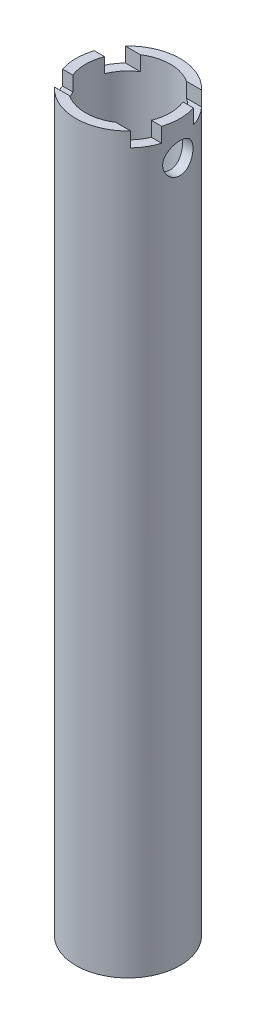
ISO-10303-21;
HEADER;
FILE_DESCRIPTION(('STEP AP214'),'2;1');
FILE_NAME('part.step','',(''),(''),'','','');
FILE_SCHEMA(('AUTOMOTIVE_DESIGN { 1 0 10303 214 1 1 1 1 }'));
ENDSEC;
DATA;
#1=APPLICATION_CONTEXT('core data for automotive mechanical design processes');
#2=APPLICATION_PROTOCOL_DEFINITION('international standard','automotive_design',2000,#1);
#3=PRODUCT_CONTEXT('',#1,'mechanical');
#4=PRODUCT('Part','Part','',(#3));
#5=PRODUCT_RELATED_PRODUCT_CATEGORY('part','',(#4));
#6=PRODUCT_DEFINITION_FORMATION('','',#4);
#7=PRODUCT_DEFINITION_CONTEXT('part definition',#1,'design');
#8=PRODUCT_DEFINITION('design','',#6,#7);
#9=PRODUCT_DEFINITION_SHAPE('','',#8);
#10=(LENGTH_UNIT() NAMED_UNIT(*) SI_UNIT(.MILLI.,.METRE.));
#11=(NAMED_UNIT(*) PLANE_ANGLE_UNIT() SI_UNIT($,.RADIAN.));
#12=(NAMED_UNIT(*) SI_UNIT($,.STERADIAN.) SOLID_ANGLE_UNIT());
#13=UNCERTAINTY_MEASURE_WITH_UNIT(LENGTH_MEASURE(1.E-05),#10,'distance_accuracy_value','');
#14=(GEOMETRIC_REPRESENTATION_CONTEXT(3) GLOBAL_UNCERTAINTY_ASSIGNED_CONTEXT((#13)) GLOBAL_UNIT_ASSIGNED_CONTEXT((#10,
#11,#12)) REPRESENTATION_CONTEXT('',''));
#15=CARTESIAN_POINT('',(0.,0.,0.));
#16=DIRECTION('',(0.,0.,1.));
#17=DIRECTION('',(1.,0.,0.));
#18=AXIS2_PLACEMENT_3D('',#15,#16,#17);
#19=CARTESIAN_POINT('',(0.,0.,0.));
#20=DIRECTION('',(0.,1.,0.));
#21=DIRECTION('',(0.,0.,1.));
#22=AXIS2_PLACEMENT_3D('',#19,#20,#21);
#23=PLANE('',#22);
#24=CARTESIAN_POINT('',(0.,0.,0.));
#25=DIRECTION('',(0.,1.,0.));
#26=DIRECTION('',(0.,0.,1.));
#27=AXIS2_PLACEMENT_3D('',#24,#25,#26);
#28=CIRCLE('',#27,10.65);
#29=CARTESIAN_POINT('',(10.1419919148065,0.,3.25));
#30=VERTEX_POINT('',#29);
#31=CARTESIAN_POINT('',(10.1419919148065,0.,-3.25));
#32=VERTEX_POINT('',#31);
#33=EDGE_CURVE('E311',#30,#32,#28,.T.);
#34=ORIENTED_EDGE('',*,*,#33,.T.);
#35=DIRECTION('',(-1.,0.,0.));
#36=VECTOR('',#35,1.);
#37=CARTESIAN_POINT('',(0.,0.,-3.25));
#38=LINE('',#37,#36);
#39=CARTESIAN_POINT('',(8.01623352953244,0.,-3.25));
#40=VERTEX_POINT('',#39);
#41=EDGE_CURVE('E182',#32,#40,#38,.T.);
#42=ORIENTED_EDGE('',*,*,#41,.T.);
#43=CARTESIAN_POINT('',(0.,0.,0.));
#44=DIRECTION('',(0.,1.,0.));
#45=DIRECTION('',(0.,0.,1.));
#46=AXIS2_PLACEMENT_3D('',#43,#44,#45);
#47=CIRCLE('',#46,8.65);
#48=CARTESIAN_POINT('',(8.01623352953244,0.,3.25));
#49=VERTEX_POINT('',#48);
#50=EDGE_CURVE('E306',#49,#40,#47,.T.);
#51=ORIENTED_EDGE('',*,*,#50,.F.);
#52=DIRECTION('',(1.,0.,0.));
#53=VECTOR('',#52,1.);
#54=CARTESIAN_POINT('',(0.,0.,3.25));
#55=LINE('',#54,#53);
#56=EDGE_CURVE('E226',#49,#30,#55,.T.);
#57=ORIENTED_EDGE('',*,*,#56,.T.);
#58=EDGE_LOOP('',(#34,#42,#51,#57));
#59=FACE_BOUND('',#58,.T.);
#60=ADVANCED_FACE('F62',(#59),#23,.T.);
#61=CARTESIAN_POINT('',(-8.01623352953244,0.,-3.25));
#62=VERTEX_POINT('',#61);
#63=CARTESIAN_POINT('',(-8.01623352953244,0.,3.25));
#64=VERTEX_POINT('',#63);
#65=EDGE_CURVE('E307',#62,#64,#47,.T.);
#66=ORIENTED_EDGE('',*,*,#65,.F.);
#67=CARTESIAN_POINT('',(-10.1419919148065,0.,-3.25));
#68=VERTEX_POINT('',#67);
#69=EDGE_CURVE('E198',#62,#68,#38,.T.);
#70=ORIENTED_EDGE('',*,*,#69,.T.);
#71=CARTESIAN_POINT('',(-10.1419919148065,0.,3.25));
#72=VERTEX_POINT('',#71);
#73=EDGE_CURVE('E196',#68,#72,#28,.T.);
#74=ORIENTED_EDGE('',*,*,#73,.T.);
#75=EDGE_CURVE('E222',#72,#64,#55,.T.);
#76=ORIENTED_EDGE('',*,*,#75,.T.);
#77=EDGE_LOOP('',(#66,#70,#74,#76));
#78=FACE_BOUND('',#77,.T.);
#79=ADVANCED_FACE('F339',(#78),#23,.T.);
#80=DIRECTION('',(-1.,0.,0.));
#81=VECTOR('',#80,1.);
#82=CARTESIAN_POINT('',(0.,0.,-7.25));
#83=LINE('',#82,#81);
#84=CARTESIAN_POINT('',(7.80128194593683,0.,-7.25));
#85=VERTEX_POINT('',#84);
#86=CARTESIAN_POINT('',(4.71805044483418,0.,-7.25));
#87=VERTEX_POINT('',#86);
#88=EDGE_CURVE('E197',#85,#87,#83,.T.);
#89=ORIENTED_EDGE('',*,*,#88,.F.);
#90=CARTESIAN_POINT('',(-7.80128194593683,0.,-7.25));
#91=VERTEX_POINT('',#90);
#92=EDGE_CURVE('E315',#85,#91,#28,.T.);
#93=ORIENTED_EDGE('',*,*,#92,.T.);
#94=CARTESIAN_POINT('',(-4.71805044483418,0.,-7.25));
#95=VERTEX_POINT('',#94);
#96=EDGE_CURVE('E202',#95,#91,#83,.T.);
#97=ORIENTED_EDGE('',*,*,#96,.F.);
#98=EDGE_CURVE('E302',#87,#95,#47,.T.);
#99=ORIENTED_EDGE('',*,*,#98,.F.);
#100=EDGE_LOOP('',(#89,#93,#97,#99));
#101=FACE_BOUND('',#100,.T.);
#102=ADVANCED_FACE('F337',(#101),#23,.T.);
#103=CARTESIAN_POINT('',(0.,-150.,0.));
#104=DIRECTION('',(0.,1.,0.));
#105=DIRECTION('',(0.,0.,1.));
#106=AXIS2_PLACEMENT_3D('',#103,#104,#105);
#107=CYLINDRICAL_SURFACE('',#106,10.65);
#108=DIRECTION('',(0.,1.,0.));
#109=VECTOR('',#108,1.);
#110=CARTESIAN_POINT('',(-7.80128194593683,-150.,-7.25));
#111=LINE('',#110,#109);
#112=CARTESIAN_POINT('',(-7.80128194593683,-3.,-7.25));
#113=VERTEX_POINT('',#112);
#114=EDGE_CURVE('E208',#91,#113,#111,.F.);
#115=ORIENTED_EDGE('',*,*,#114,.F.);
#116=ORIENTED_EDGE('',*,*,#92,.F.);
#117=DIRECTION('',(0.,1.,0.));
#118=VECTOR('',#117,1.);
#119=CARTESIAN_POINT('',(7.80128194593683,-150.,-7.25));
#120=LINE('',#119,#118);
#121=CARTESIAN_POINT('',(7.80128194593683,-3.,-7.25));
#122=VERTEX_POINT('',#121);
#123=EDGE_CURVE('E200',#122,#85,#120,.T.);
#124=ORIENTED_EDGE('',*,*,#123,.F.);
#125=CARTESIAN_POINT('',(0.,-3.,0.));
#126=DIRECTION('',(0.,1.,0.));
#127=DIRECTION('',(0.,0.,1.));
#128=AXIS2_PLACEMENT_3D('',#125,#126,#127);
#129=CIRCLE('',#128,10.65);
#130=CARTESIAN_POINT('',(10.1419919148065,-3.,-3.25));
#131=VERTEX_POINT('',#130);
#132=EDGE_CURVE('E183',#122,#131,#129,.F.);
#133=ORIENTED_EDGE('',*,*,#132,.T.);
#134=DIRECTION('',(0.,1.,0.));
#135=VECTOR('',#134,1.);
#136=CARTESIAN_POINT('',(10.1419919148065,-150.,-3.25));
#137=LINE('',#136,#135);
#138=EDGE_CURVE('E203',#131,#32,#137,.T.);
#139=ORIENTED_EDGE('',*,*,#138,.T.);
#140=ORIENTED_EDGE('',*,*,#33,.F.);
#141=DIRECTION('',(0.,1.,0.));
#142=VECTOR('',#141,1.);
#143=CARTESIAN_POINT('',(10.1419919148065,-150.,3.25));
#144=LINE('',#143,#142);
#145=CARTESIAN_POINT('',(10.1419919148065,-3.,3.25));
#146=VERTEX_POINT('',#145);
#147=EDGE_CURVE('E228',#30,#146,#144,.F.);
#148=ORIENTED_EDGE('',*,*,#147,.T.);
#149=CARTESIAN_POINT('',(0.,-3.,0.));
#150=DIRECTION('',(0.,1.,0.));
#151=DIRECTION('',(0.,0.,1.));
#152=AXIS2_PLACEMENT_3D('',#149,#150,#151);
#153=CIRCLE('',#152,10.65);
#154=CARTESIAN_POINT('',(7.80128194593683,-3.,7.25));
#155=VERTEX_POINT('',#154);
#156=EDGE_CURVE('E218',#146,#155,#153,.F.);
#157=ORIENTED_EDGE('',*,*,#156,.T.);
#158=DIRECTION('',(0.,1.,0.));
#159=VECTOR('',#158,1.);
#160=CARTESIAN_POINT('',(7.80128194593683,-150.,7.25));
#161=LINE('',#160,#159);
#162=CARTESIAN_POINT('',(7.80128194593683,0.,7.25));
#163=VERTEX_POINT('',#162);
#164=EDGE_CURVE('E236',#163,#155,#161,.F.);
#165=ORIENTED_EDGE('',*,*,#164,.F.);
#166=CARTESIAN_POINT('',(-7.80128194593683,0.,7.25));
#167=VERTEX_POINT('',#166);
#168=EDGE_CURVE('E269',#167,#163,#28,.T.);
#169=ORIENTED_EDGE('',*,*,#168,.F.);
#170=DIRECTION('',(0.,1.,0.));
#171=VECTOR('',#170,1.);
#172=CARTESIAN_POINT('',(-7.80128194593683,-150.,7.25));
#173=LINE('',#172,#171);
#174=CARTESIAN_POINT('',(-7.80128194593683,-3.,7.25));
#175=VERTEX_POINT('',#174);
#176=EDGE_CURVE('E233',#175,#167,#173,.T.);
#177=ORIENTED_EDGE('',*,*,#176,.F.);
#178=CARTESIAN_POINT('',(-10.1419919148065,-3.,3.25));
#179=VERTEX_POINT('',#178);
#180=EDGE_CURVE('E221',#175,#179,#153,.F.);
#181=ORIENTED_EDGE('',*,*,#180,.T.);
#182=DIRECTION('',(0.,1.,0.));
#183=VECTOR('',#182,1.);
#184=CARTESIAN_POINT('',(-10.1419919148065,-150.,3.25));
#185=LINE('',#184,#183);
#186=EDGE_CURVE('E225',#179,#72,#185,.T.);
#187=ORIENTED_EDGE('',*,*,#186,.T.);
#188=ORIENTED_EDGE('',*,*,#73,.F.);
#189=DIRECTION('',(0.,1.,0.));
#190=VECTOR('',#189,1.);
#191=CARTESIAN_POINT('',(-10.1419919148065,-150.,-3.25));
#192=LINE('',#191,#190);
#193=CARTESIAN_POINT('',(-10.1419919148065,-3.,-3.25));
#194=VERTEX_POINT('',#193);
#195=EDGE_CURVE('E187',#68,#194,#192,.F.);
#196=ORIENTED_EDGE('',*,*,#195,.T.);
#197=EDGE_CURVE('E175',#194,#113,#129,.F.);
#198=ORIENTED_EDGE('',*,*,#197,.T.);
#199=EDGE_LOOP('',(#115,#116,#124,#133,#139,#140,#148,#157,#165,#169,#177,#181,#187,#188,#196,#198));
#200=FACE_BOUND('',#199,.T.);
#201=CARTESIAN_POINT('',(10.1888419361574,-7.,-3.1));
#202=CARTESIAN_POINT('',(10.1888441057503,-6.82987835471398,-3.09999727152298));
#203=CARTESIAN_POINT('',(10.1931493007926,-6.65972941708513,-3.08594844823669));
#204=CARTESIAN_POINT('',(10.2098410434388,-6.32438918117467,-3.03025830053538));
#205=CARTESIAN_POINT('',(10.2222306584506,-6.15919978954915,-2.98860650284716));
#206=CARTESIAN_POINT('',(10.25357172788,-5.83868050258358,-2.87923098039983));
#207=CARTESIAN_POINT('',(10.2725127392617,-5.68333537881959,-2.81154872951785));
#208=CARTESIAN_POINT('',(10.3148085299741,-5.38617028604735,-2.65216822465537));
#209=CARTESIAN_POINT('',(10.3381638845888,-5.24435208351645,-2.5604668398636));
#210=CARTESIAN_POINT('',(10.3874370057661,-4.97404162055039,-2.35272705808078));
#211=CARTESIAN_POINT('',(10.4134068954617,-4.84601196689376,-2.23609894723779));
#212=CARTESIAN_POINT('',(10.4645364221232,-4.61102455351764,-1.98308140257185));
#213=CARTESIAN_POINT('',(10.489695960539,-4.50406934871532,-1.84668957620989));
#214=CARTESIAN_POINT('',(10.5369591710148,-4.31228038081969,-1.55474845165297));
#215=CARTESIAN_POINT('',(10.5589942439578,-4.22791502560216,-1.39887935991856));
#216=CARTESIAN_POINT('',(10.5969222886104,-4.08677017969808,-1.07441716335687));
#217=CARTESIAN_POINT('',(10.612816503514,-4.02998510488672,-0.905826642205307));
#218=CARTESIAN_POINT('',(10.6363032535631,-3.94713425229078,-0.565544079407322));
#219=CARTESIAN_POINT('',(10.6441085813227,-3.9202795799392,-0.394059065436716));
#220=CARTESIAN_POINT('',(10.6512859901131,-3.89556082082881,-0.0488518243476302));
#221=CARTESIAN_POINT('',(10.6506597421006,-3.89769098989953,0.124869952675086));
#222=CARTESIAN_POINT('',(10.6411965128448,-3.93034465483563,0.46409708368491));
#223=CARTESIAN_POINT('',(10.6326064209459,-3.96001442086737,0.629692579767296));
#224=CARTESIAN_POINT('',(10.6084783016649,-4.04551477773604,0.953443488939181));
#225=CARTESIAN_POINT('',(10.5929398447781,-4.10134698578287,1.11159844143246));
#226=CARTESIAN_POINT('',(10.556312714695,-4.23818625085715,1.4180496868094));
#227=CARTESIAN_POINT('',(10.5351637973608,-4.31946840452005,1.56621564424446));
#228=CARTESIAN_POINT('',(10.4895690731987,-4.50468458581063,1.84708301522959));
#229=CARTESIAN_POINT('',(10.4651225218995,-4.60862373173712,1.97978092407758));
#230=CARTESIAN_POINT('',(10.4145085770061,-4.84066100978718,2.23104175007879));
#231=CARTESIAN_POINT('',(10.3883109340845,-4.96950042361061,2.34891489353613));
#232=CARTESIAN_POINT('',(10.3379318943086,-5.2453784722716,2.56156962710448));
#233=CARTESIAN_POINT('',(10.3137506743119,-5.39241870067223,2.65634919310942));
#234=CARTESIAN_POINT('',(10.2700037871355,-5.7022502200893,2.82078996550857));
#235=CARTESIAN_POINT('',(10.2504794060492,-5.86516557949654,2.89022918670249));
#236=CARTESIAN_POINT('',(10.2187517893602,-6.20107492991019,3.00049014503662));
#237=CARTESIAN_POINT('',(10.20654632904,-6.37406584071219,3.04132057896857));
#238=CARTESIAN_POINT('',(10.191322879948,-6.71868200797506,3.09194382708414));
#239=CARTESIAN_POINT('',(10.1879962663103,-6.89014053945853,3.1027797548745));
#240=CARTESIAN_POINT('',(10.1900562132623,-7.23242724952157,3.09600860569731));
#241=CARTESIAN_POINT('',(10.1954416384946,-7.40325550733097,3.07840523495467));
#242=CARTESIAN_POINT('',(10.2140172443717,-7.7351758871437,3.01618171783668));
#243=CARTESIAN_POINT('',(10.2270168373842,-7.89640331192945,2.97222070620975));
#244=CARTESIAN_POINT('',(10.2591617076393,-8.20918718798164,2.85928755922712));
#245=CARTESIAN_POINT('',(10.2783078950711,-8.36074220296846,2.79031171947375));
#246=CARTESIAN_POINT('',(10.3211967948522,-8.65415553097118,2.62729011881327));
#247=CARTESIAN_POINT('',(10.3450443733836,-8.79566752569532,2.53264930365096));
#248=CARTESIAN_POINT('',(10.3944179860008,-9.06118338777822,2.32169936910348));
#249=CARTESIAN_POINT('',(10.419944397114,-9.18518330250806,2.2053853715892));
#250=CARTESIAN_POINT('',(10.4708879331935,-9.41665245937621,1.94950844514348));
#251=CARTESIAN_POINT('',(10.4962695262011,-9.52338542798524,1.80927082274462));
#252=CARTESIAN_POINT('',(10.5431532711981,-9.71181386531733,1.51227826770432));
#253=CARTESIAN_POINT('',(10.5646556229435,-9.79351062339549,1.355524186213));
#254=CARTESIAN_POINT('',(10.6012229511761,-9.92876303130464,1.03101854405395));
#255=CARTESIAN_POINT('',(10.6163363619921,-9.98253114645553,0.863361268630194));
#256=CARTESIAN_POINT('',(10.6386369079939,-10.0609685591747,0.520875459021169));
#257=CARTESIAN_POINT('',(10.6458261663449,-10.0856456513969,0.346048858783191));
#258=CARTESIAN_POINT('',(10.6513470969274,-10.1046362283856,0.00101089861311552));
#259=CARTESIAN_POINT('',(10.6499911849361,-10.1000206245671,-0.169137279447993));
#260=CARTESIAN_POINT('',(10.6393021777788,-10.0630964344509,-0.506131642647187));
#261=CARTESIAN_POINT('',(10.6299694901495,-10.0307892629257,-0.672977996031203));
#262=CARTESIAN_POINT('',(10.604457460481,-9.94004723158736,-0.997086068952581));
#263=CARTESIAN_POINT('',(10.5883446248182,-9.88186586432684,-1.15442435027252));
#264=CARTESIAN_POINT('',(10.5509425806665,-9.7412528029522,-1.45719132923713));
#265=CARTESIAN_POINT('',(10.5296525515813,-9.65881726406367,-1.602618133997));
#266=CARTESIAN_POINT('',(10.483333940895,-9.46910706227823,-1.88226608877159));
#267=CARTESIAN_POINT('',(10.4582109129596,-9.36114965976719,-2.01600832446907));
#268=CARTESIAN_POINT('',(10.4073807615634,-9.12470766237661,-2.2638379450713));
#269=CARTESIAN_POINT('',(10.381673475975,-8.99621730858273,-2.37791979707959));
#270=CARTESIAN_POINT('',(10.3317560790232,-8.71810309580794,-2.5863370424073));
#271=CARTESIAN_POINT('',(10.3076067635984,-8.56799435534128,-2.68004150275658));
#272=CARTESIAN_POINT('',(10.2644780911802,-8.25347252445207,-2.84076683294284));
#273=CARTESIAN_POINT('',(10.2454959914046,-8.08906708417627,-2.90780186779073));
#274=CARTESIAN_POINT('',(10.2169437838262,-7.77154285546914,-3.00646943360063));
#275=CARTESIAN_POINT('',(10.2065010177036,-7.61953645903448,-3.04145092896509));
#276=CARTESIAN_POINT('',(10.1924496902661,-7.31169390015436,-3.0882154584601));
#277=CARTESIAN_POINT('',(10.1888399484663,-7.15585840394384,-3.10000249971762));
#278=CARTESIAN_POINT('',(10.1888419361574,-7.,-3.1));
#279=B_SPLINE_CURVE_WITH_KNOTS('',3,(#201,#202,#203,#204,#205,#206,#207,#208,#209,#210,#211,
#212,#213,#214,#215,#216,#217,#218,#219,#220,#221,#222,#223,#224,#225,#226,#227,#228,#229,#230,
#231,#232,#233,#234,#235,#236,#237,#238,#239,#240,#241,#242,#243,#244,#245,#246,#247,#248,#249,
#250,#251,#252,#253,#254,#255,#256,#257,#258,#259,#260,#261,#262,#263,#264,#265,#266,#267,#268,
#269,#270,#271,#272,#273,#274,#275,#276,#277,#278),.UNSPECIFIED.,.T.,.F.,(4,2,2,2,2,2,2,2,2,2,2,
2,2,2,2,2,2,2,2,2,2,2,2,2,2,2,2,2,2,2,2,2,2,2,2,2,2,2,4),(0.,0.50979052428436,1.01977458693838,
1.5289494445066,2.03819070431847,2.56116742129301,3.08420750131008,3.61737461167768,
4.15043372770851,4.669083478286,5.18763044516546,5.69062076890831,6.19364218868785,
6.70230043234714,7.21107370309876,7.73835435822127,8.26568121183146,8.79752251972448,
9.32920208283187,9.84214424855111,10.3550195727591,10.8555749809802,11.3562045457754,
11.8696146328054,12.3831404163915,12.9147576133443,13.4463474276157,13.9738316882777,
14.5011745825673,15.0093522416927,15.5175039393781,16.0207832831433,16.5241424498381,
17.0429006374553,17.5618045783221,18.0950108927676,18.6279336244642,19.095063293686,
19.5621122534293),.UNSPECIFIED.);
#280=CARTESIAN_POINT('',(10.1888419361574,-7.,-3.1));
#281=VERTEX_POINT('',#280);
#282=EDGE_CURVE('E239',#281,#281,#279,.T.);
#283=ORIENTED_EDGE('',*,*,#282,.F.);
#284=EDGE_LOOP('',(#283));
#285=FACE_BOUND('',#284,.T.);
#286=CARTESIAN_POINT('',(0.,-150.,0.));
#287=DIRECTION('',(0.,1.,0.));
#288=DIRECTION('',(0.,0.,1.));
#289=AXIS2_PLACEMENT_3D('',#286,#287,#288);
#290=CIRCLE('',#289,10.65);
#291=CARTESIAN_POINT('',(0.,-150.,10.65));
#292=VERTEX_POINT('',#291);
#293=EDGE_CURVE('E274',#292,#292,#290,.T.);
#294=ORIENTED_EDGE('',*,*,#293,.T.);
#295=EDGE_LOOP('',(#294));
#296=FACE_BOUND('',#295,.T.);
#297=ADVANCED_FACE('F64',(#200,#285,#296),#107,.T.);
#298=CARTESIAN_POINT('',(0.,-150.,0.));
#299=DIRECTION('',(0.,1.,0.));
#300=DIRECTION('',(0.,0.,1.));
#301=AXIS2_PLACEMENT_3D('',#298,#299,#300);
#302=PLANE('',#301);
#303=CARTESIAN_POINT('',(0.,-150.,0.));
#304=DIRECTION('',(0.,1.,0.));
#305=DIRECTION('',(0.,0.,1.));
#306=AXIS2_PLACEMENT_3D('',#303,#304,#305);
#307=CIRCLE('',#306,8.65);
#308=CARTESIAN_POINT('',(0.,-150.,8.65));
#309=VERTEX_POINT('',#308);
#310=EDGE_CURVE('E247',#309,#309,#307,.T.);
#311=ORIENTED_EDGE('',*,*,#310,.T.);
#312=EDGE_LOOP('',(#311));
#313=FACE_BOUND('',#312,.T.);
#314=ORIENTED_EDGE('',*,*,#293,.F.);
#315=EDGE_LOOP('',(#314));
#316=FACE_BOUND('',#315,.T.);
#317=ADVANCED_FACE('F329',(#313,#316),#302,.F.);
#318=DIRECTION('',(1.,0.,0.));
#319=VECTOR('',#318,1.);
#320=CARTESIAN_POINT('',(0.,0.,7.25));
#321=LINE('',#320,#319);
#322=CARTESIAN_POINT('',(-4.71805044483418,0.,7.25));
#323=VERTEX_POINT('',#322);
#324=EDGE_CURVE('E231',#167,#323,#321,.T.);
#325=ORIENTED_EDGE('',*,*,#324,.F.);
#326=ORIENTED_EDGE('',*,*,#168,.T.);
#327=CARTESIAN_POINT('',(4.71805044483418,0.,7.25));
#328=VERTEX_POINT('',#327);
#329=EDGE_CURVE('E234',#328,#163,#321,.T.);
#330=ORIENTED_EDGE('',*,*,#329,.F.);
#331=EDGE_CURVE('E246',#323,#328,#47,.T.);
#332=ORIENTED_EDGE('',*,*,#331,.F.);
#333=EDGE_LOOP('',(#325,#326,#330,#332));
#334=FACE_BOUND('',#333,.T.);
#335=ADVANCED_FACE('F333',(#334),#23,.T.);
#336=CARTESIAN_POINT('',(0.,-150.,0.));
#337=DIRECTION('',(0.,1.,0.));
#338=DIRECTION('',(0.,0.,1.));
#339=AXIS2_PLACEMENT_3D('',#336,#337,#338);
#340=CYLINDRICAL_SURFACE('',#339,8.65);
#341=ORIENTED_EDGE('',*,*,#98,.T.);
#342=DIRECTION('',(0.,1.,0.));
#343=VECTOR('',#342,1.);
#344=CARTESIAN_POINT('',(-4.71805044483418,-150.,-7.25));
#345=LINE('',#344,#343);
#346=CARTESIAN_POINT('',(-4.71805044483418,-3.,-7.25));
#347=VERTEX_POINT('',#346);
#348=EDGE_CURVE('E14',#95,#347,#345,.F.);
#349=ORIENTED_EDGE('',*,*,#348,.T.);
#350=CARTESIAN_POINT('',(0.,-3.,0.));
#351=DIRECTION('',(0.,1.,0.));
#352=DIRECTION('',(0.,0.,1.));
#353=AXIS2_PLACEMENT_3D('',#350,#351,#352);
#354=CIRCLE('',#353,8.65);
#355=CARTESIAN_POINT('',(-8.01623352953244,-3.,-3.25));
#356=VERTEX_POINT('',#355);
#357=EDGE_CURVE('E290',#356,#347,#354,.F.);
#358=ORIENTED_EDGE('',*,*,#357,.F.);
#359=DIRECTION('',(0.,1.,0.));
#360=VECTOR('',#359,1.);
#361=CARTESIAN_POINT('',(-8.01623352953244,-150.,-3.25));
#362=LINE('',#361,#360);
#363=EDGE_CURVE('E71',#62,#356,#362,.F.);
#364=ORIENTED_EDGE('',*,*,#363,.F.);
#365=ORIENTED_EDGE('',*,*,#65,.T.);
#366=DIRECTION('',(0.,1.,0.));
#367=VECTOR('',#366,1.);
#368=CARTESIAN_POINT('',(-8.01623352953244,-150.,3.25));
#369=LINE('',#368,#367);
#370=CARTESIAN_POINT('',(-8.01623352953244,-3.,3.25));
#371=VERTEX_POINT('',#370);
#372=EDGE_CURVE('E281',#371,#64,#369,.T.);
#373=ORIENTED_EDGE('',*,*,#372,.F.);
#374=CARTESIAN_POINT('',(0.,-3.,0.));
#375=DIRECTION('',(0.,1.,0.));
#376=DIRECTION('',(0.,0.,1.));
#377=AXIS2_PLACEMENT_3D('',#374,#375,#376);
#378=CIRCLE('',#377,8.65);
#379=CARTESIAN_POINT('',(-4.71805044483418,-3.,7.25));
#380=VERTEX_POINT('',#379);
#381=EDGE_CURVE('E275',#380,#371,#378,.F.);
#382=ORIENTED_EDGE('',*,*,#381,.F.);
#383=DIRECTION('',(0.,1.,0.));
#384=VECTOR('',#383,1.);
#385=CARTESIAN_POINT('',(-4.71805044483418,-150.,7.25));
#386=LINE('',#385,#384);
#387=EDGE_CURVE('E284',#380,#323,#386,.T.);
#388=ORIENTED_EDGE('',*,*,#387,.T.);
#389=ORIENTED_EDGE('',*,*,#331,.T.);
#390=DIRECTION('',(0.,1.,0.));
#391=VECTOR('',#390,1.);
#392=CARTESIAN_POINT('',(4.71805044483418,-150.,7.25));
#393=LINE('',#392,#391);
#394=CARTESIAN_POINT('',(4.71805044483418,-3.,7.25));
#395=VERTEX_POINT('',#394);
#396=EDGE_CURVE('E278',#328,#395,#393,.F.);
#397=ORIENTED_EDGE('',*,*,#396,.T.);
#398=CARTESIAN_POINT('',(8.01623352953244,-3.,3.25));
#399=VERTEX_POINT('',#398);
#400=EDGE_CURVE('E271',#399,#395,#378,.F.);
#401=ORIENTED_EDGE('',*,*,#400,.F.);
#402=DIRECTION('',(0.,1.,0.));
#403=VECTOR('',#402,1.);
#404=CARTESIAN_POINT('',(8.01623352953244,-150.,3.25));
#405=LINE('',#404,#403);
#406=EDGE_CURVE('E273',#49,#399,#405,.F.);
#407=ORIENTED_EDGE('',*,*,#406,.F.);
#408=ORIENTED_EDGE('',*,*,#50,.T.);
#409=DIRECTION('',(0.,1.,0.));
#410=VECTOR('',#409,1.);
#411=CARTESIAN_POINT('',(8.01623352953244,-150.,-3.25));
#412=LINE('',#411,#410);
#413=CARTESIAN_POINT('',(8.01623352953244,-3.,-3.25));
#414=VERTEX_POINT('',#413);
#415=EDGE_CURVE('E289',#414,#40,#412,.T.);
#416=ORIENTED_EDGE('',*,*,#415,.F.);
#417=CARTESIAN_POINT('',(4.71805044483418,-3.,-7.25));
#418=VERTEX_POINT('',#417);
#419=EDGE_CURVE('E287',#418,#414,#354,.F.);
#420=ORIENTED_EDGE('',*,*,#419,.F.);
#421=DIRECTION('',(0.,1.,0.));
#422=VECTOR('',#421,1.);
#423=CARTESIAN_POINT('',(4.71805044483418,-150.,-7.25));
#424=LINE('',#423,#422);
#425=EDGE_CURVE('E292',#418,#87,#424,.T.);
#426=ORIENTED_EDGE('',*,*,#425,.T.);
#427=EDGE_LOOP('',(#341,#349,#358,#364,#365,#373,#382,#388,#389,#397,#401,#407,#408,#416,#420,#426));
#428=FACE_BOUND('',#427,.T.);
#429=CARTESIAN_POINT('',(8.07542568537412,-7.,-3.1));
#430=CARTESIAN_POINT('',(8.07542233782002,-6.83198959456713,-3.10000380313353));
#431=CARTESIAN_POINT('',(8.08072602099948,-6.66400541447108,-3.08629575774146));
#432=CARTESIAN_POINT('',(8.10123510078386,-6.33306599972194,-3.03204831985805));
#433=CARTESIAN_POINT('',(8.11644092955894,-6.17011098488732,-2.99150775628458));
#434=CARTESIAN_POINT('',(8.15481539820621,-5.85408984051061,-2.88524455098353));
#435=CARTESIAN_POINT('',(8.17796640926718,-5.70100270182905,-2.81957762299872));
#436=CARTESIAN_POINT('',(8.22959546746569,-5.40796171327764,-2.66512047772629));
#437=CARTESIAN_POINT('',(8.25807495435342,-5.26801142835973,-2.57632400830463));
#438=CARTESIAN_POINT('',(8.31859874209237,-4.99887448520454,-2.37381793375204));
#439=CARTESIAN_POINT('',(8.35074155191664,-4.87036849539607,-2.25923291054817));
#440=CARTESIAN_POINT('',(8.41414419149071,-4.63392310673716,-2.01026424998966));
#441=CARTESIAN_POINT('',(8.44540385216568,-4.52598762359219,-1.87587685176321));
#442=CARTESIAN_POINT('',(8.50467642422263,-4.33054754109322,-1.5860296231461));
#443=CARTESIAN_POINT('',(8.53256021372728,-4.24377181814437,-1.43004956569979));
#444=CARTESIAN_POINT('',(8.58076493943372,-4.09796892883706,-1.1045317098825));
#445=CARTESIAN_POINT('',(8.6010882546175,-4.03893303231239,-0.934998196681555));
#446=CARTESIAN_POINT('',(8.63118353487815,-3.95264010048989,-0.594334122906921));
#447=CARTESIAN_POINT('',(8.64134264389183,-3.9242136212207,-0.423534648443659));
#448=CARTESIAN_POINT('',(8.65134799401296,-3.89621119190994,-0.0793077938822485));
#449=CARTESIAN_POINT('',(8.65119729986184,-3.89662666817114,0.0941187899426907));
#450=CARTESIAN_POINT('',(8.64085295369663,-3.92559022189375,0.430338167573701));
#451=CARTESIAN_POINT('',(8.63111402715771,-3.95286452385534,0.593257052157645));
#452=CARTESIAN_POINT('',(8.6032733986702,-4.03264381517383,0.912030316167054));
#453=CARTESIAN_POINT('',(8.58517111209876,-4.08515056836172,1.06788420089229));
#454=CARTESIAN_POINT('',(8.5420976334551,-4.21455689232964,1.37069540755739));
#455=CARTESIAN_POINT('',(8.5170334204387,-4.29178912804415,1.51749678675591));
#456=CARTESIAN_POINT('',(8.46260268287722,-4.46816867821915,1.79640692628605));
#457=CARTESIAN_POINT('',(8.43323484262627,-4.56732269934535,1.92851117160132));
#458=CARTESIAN_POINT('',(8.37138539433572,-4.79098673794026,2.18181567077155));
#459=CARTESIAN_POINT('',(8.33882127228128,-4.916574899927,2.30204523221957));
#460=CARTESIAN_POINT('',(8.2755427454282,-5.18636316813067,2.520081715627));
#461=CARTESIAN_POINT('',(8.24482872681689,-5.33056714056994,2.61788396802608));
#462=CARTESIAN_POINT('',(8.18823511923222,-5.63700917998839,2.78992673901901));
#463=CARTESIAN_POINT('',(8.16245681844251,-5.79953436188777,2.86369179779753));
#464=CARTESIAN_POINT('',(8.11982135049482,-6.13586338702395,2.98245373407905));
#465=CARTESIAN_POINT('',(8.10295973343434,-6.30966155572615,3.02746496361951));
#466=CARTESIAN_POINT('',(8.08109859907995,-6.65408278375662,3.08532963635387));
#467=CARTESIAN_POINT('',(8.07553633138493,-6.82441336578721,3.09971051103132));
#468=CARTESIAN_POINT('',(8.07531843842961,-7.16510782508341,3.1002806341983));
#469=CARTESIAN_POINT('',(8.08066041330784,-7.33547168677342,3.0864760858797));
#470=CARTESIAN_POINT('',(8.10108171969688,-7.6639393738002,3.03244752745281));
#471=CARTESIAN_POINT('',(8.11574414130696,-7.82225789362762,2.99335347253063));
#472=CARTESIAN_POINT('',(8.15267441413555,-8.13003365109962,2.89124997455237));
#473=CARTESIAN_POINT('',(8.17494374009011,-8.27948916389123,2.82823589390268));
#474=CARTESIAN_POINT('',(8.22554724175769,-8.57114784136929,2.67757025631734));
#475=CARTESIAN_POINT('',(8.2540675658627,-8.7129095205052,2.58912837690864));
#476=CARTESIAN_POINT('',(8.31362737910438,-8.98012660335563,2.39098047728874));
#477=CARTESIAN_POINT('',(8.34466771686225,-9.10557647671815,2.2812672764948));
#478=CARTESIAN_POINT('',(8.40790834675693,-9.34401310049569,2.03628306446398));
#479=CARTESIAN_POINT('',(8.44007395687062,-9.45588243610479,1.89991199415683));
#480=CARTESIAN_POINT('',(8.50022573841191,-9.65525772678507,1.60953899364014));
#481=CARTESIAN_POINT('',(8.52821197462918,-9.74276405955563,1.45553733680965));
#482=CARTESIAN_POINT('',(8.57677887971909,-9.89023798929713,1.13469216034847));
#483=CARTESIAN_POINT('',(8.59739608024931,-9.95034185369241,0.967917110924003));
#484=CARTESIAN_POINT('',(8.6290458331891,-10.0413441335022,0.625726217172641));
#485=CARTESIAN_POINT('',(8.6400824531192,-10.0722549435779,0.450314073259353));
#486=CARTESIAN_POINT('',(8.65097390906914,-10.1027456213503,0.105975072210067));
#487=CARTESIAN_POINT('',(8.65139751766496,-10.1039192072649,-0.0627940412719361));
#488=CARTESIAN_POINT('',(8.64246424170819,-10.0789324448114,-0.398015517935068));
#489=CARTESIAN_POINT('',(8.63310836957004,-10.0527749258784,-0.564468119124137));
#490=CARTESIAN_POINT('',(8.60590748707151,-9.97496669414953,-0.886856214524017));
#491=CARTESIAN_POINT('',(8.58824227083488,-9.92385507853587,-1.04293811410244));
#492=CARTESIAN_POINT('',(8.5462515472123,-9.79810947867279,-1.34434519784151));
#493=CARTESIAN_POINT('',(8.52192479051414,-9.7234710817893,-1.48966835779616));
#494=CARTESIAN_POINT('',(8.46785849191843,-9.5493598145447,-1.77181860050029));
#495=CARTESIAN_POINT('',(8.43794068140346,-9.44900928418986,-1.90806936491389));
#496=CARTESIAN_POINT('',(8.37640055614901,-9.22774934156927,-2.16230270267295));
#497=CARTESIAN_POINT('',(8.34477765949265,-9.10683287977963,-2.28027898536621));
#498=CARTESIAN_POINT('',(8.28158767301326,-8.84108511779239,-2.50030731345727));
#499=CARTESIAN_POINT('',(8.25009338311968,-8.69539559309408,-2.60134743933056));
#500=CARTESIAN_POINT('',(8.19247290413051,-8.38810665527686,-2.77750131159969));
#501=CARTESIAN_POINT('',(8.16634641253283,-8.22650813946819,-2.85261651915573));
#502=CARTESIAN_POINT('',(8.12267038186309,-7.89058150571383,-2.97472701199815));
#503=CARTESIAN_POINT('',(8.10518050562055,-7.71617414382481,-3.02152717958956));
#504=CARTESIAN_POINT('',(8.08156286267143,-7.36116561263297,-3.08415370670806));
#505=CARTESIAN_POINT('',(8.07542928312754,-7.18056766029178,-3.09999591261671));
#506=CARTESIAN_POINT('',(8.07542568537412,-7.,-3.1));
#507=B_SPLINE_CURVE_WITH_KNOTS('',3,(#429,#430,#431,#432,#433,#434,#435,#436,#437,#438,#439,
#440,#441,#442,#443,#444,#445,#446,#447,#448,#449,#450,#451,#452,#453,#454,#455,#456,#457,#458,
#459,#460,#461,#462,#463,#464,#465,#466,#467,#468,#469,#470,#471,#472,#473,#474,#475,#476,#477,
#478,#479,#480,#481,#482,#483,#484,#485,#486,#487,#488,#489,#490,#491,#492,#493,#494,#495,#496,
#497,#498,#499,#500,#501,#502,#503,#504,#505,#506),.UNSPECIFIED.,.T.,.F.,(4,2,2,2,2,2,2,2,2,2,2,
2,2,2,2,2,2,2,2,2,2,2,2,2,2,2,2,2,2,2,2,2,2,2,2,2,2,2,4),(0.,0.503360344799801,1.00674265977679,
1.50901521223586,2.01142367486991,2.53452347391774,3.05772274855812,3.59698269710109,
4.13607281807049,4.65374376652758,5.1712608303092,5.66536163246663,6.15949697891355,
6.66058162878324,7.16181979119669,7.69005827589503,8.21840664476878,8.75664783951948,
9.29462016900079,9.80506887583581,10.3154052526219,10.8043817735454,11.2934531452685,
11.7997679244514,12.3062539193842,12.8415988313657,13.3769354434382,13.9095800840287,
14.4419984748531,14.9458187028277,15.4495867783034,15.9429234457665,16.4363526975393,
16.9496160445171,17.4630556821373,18.0006815203627,18.5382770523864,19.0795361459095,
19.6205181137227),.UNSPECIFIED.);
#508=CARTESIAN_POINT('',(8.07542568537412,-7.,-3.1));
#509=VERTEX_POINT('',#508);
#510=EDGE_CURVE('E238',#509,#509,#507,.T.);
#511=ORIENTED_EDGE('',*,*,#510,.T.);
#512=EDGE_LOOP('',(#511));
#513=FACE_BOUND('',#512,.T.);
#514=ORIENTED_EDGE('',*,*,#310,.F.);
#515=EDGE_LOOP('',(#514));
#516=FACE_BOUND('',#515,.T.);
#517=ADVANCED_FACE('F255',(#428,#513,#516),#340,.F.);
#518=CARTESIAN_POINT('',(3.65000000000001,-7.,0.));
#519=DIRECTION('',(1.,0.,0.));
#520=DIRECTION('',(0.,0.,-1.));
#521=AXIS2_PLACEMENT_3D('',#518,#519,#520);
#522=CYLINDRICAL_SURFACE('',#521,3.1);
#523=ORIENTED_EDGE('',*,*,#282,.T.);
#524=EDGE_LOOP('',(#523));
#525=FACE_BOUND('',#524,.T.);
#526=ORIENTED_EDGE('',*,*,#510,.F.);
#527=EDGE_LOOP('',(#526));
#528=FACE_BOUND('',#527,.T.);
#529=ADVANCED_FACE('F249',(#525,#528),#522,.F.);
#530=CARTESIAN_POINT('',(10.65,-3.,7.25));
#531=DIRECTION('',(0.,1.,0.));
#532=DIRECTION('',(0.,0.,1.));
#533=AXIS2_PLACEMENT_3D('',#530,#531,#532);
#534=PLANE('',#533);
#535=DIRECTION('',(1.,0.,0.));
#536=VECTOR('',#535,1.);
#537=CARTESIAN_POINT('',(10.65,-3.,3.25));
#538=LINE('',#537,#536);
#539=EDGE_CURVE('E210',#399,#146,#538,.T.);
#540=ORIENTED_EDGE('',*,*,#539,.F.);
#541=ORIENTED_EDGE('',*,*,#400,.T.);
#542=DIRECTION('',(1.,0.,0.));
#543=VECTOR('',#542,1.);
#544=CARTESIAN_POINT('',(10.65,-3.,7.25));
#545=LINE('',#544,#543);
#546=EDGE_CURVE('E211',#395,#155,#545,.T.);
#547=ORIENTED_EDGE('',*,*,#546,.T.);
#548=ORIENTED_EDGE('',*,*,#156,.F.);
#549=EDGE_LOOP('',(#540,#541,#547,#548));
#550=FACE_BOUND('',#549,.T.);
#551=ADVANCED_FACE('F254',(#550),#534,.T.);
#552=CARTESIAN_POINT('',(-52.2585330504188,0.,3.25));
#553=DIRECTION('',(0.,0.,1.));
#554=DIRECTION('',(1.,0.,0.));
#555=AXIS2_PLACEMENT_3D('',#552,#553,#554);
#556=PLANE('',#555);
#557=ORIENTED_EDGE('',*,*,#56,.F.);
#558=ORIENTED_EDGE('',*,*,#406,.T.);
#559=ORIENTED_EDGE('',*,*,#539,.T.);
#560=ORIENTED_EDGE('',*,*,#147,.F.);
#561=EDGE_LOOP('',(#557,#558,#559,#560));
#562=FACE_BOUND('',#561,.T.);
#563=ADVANCED_FACE('F369',(#562),#556,.T.);
#564=CARTESIAN_POINT('',(-52.2585330504188,0.,7.25));
#565=DIRECTION('',(0.,0.,1.));
#566=DIRECTION('',(1.,0.,0.));
#567=AXIS2_PLACEMENT_3D('',#564,#565,#566);
#568=PLANE('',#567);
#569=ORIENTED_EDGE('',*,*,#164,.T.);
#570=ORIENTED_EDGE('',*,*,#546,.F.);
#571=ORIENTED_EDGE('',*,*,#396,.F.);
#572=ORIENTED_EDGE('',*,*,#329,.T.);
#573=EDGE_LOOP('',(#569,#570,#571,#572));
#574=FACE_BOUND('',#573,.T.);
#575=ADVANCED_FACE('F374',(#574),#568,.F.);
#576=EDGE_CURVE('E214',#175,#380,#545,.T.);
#577=ORIENTED_EDGE('',*,*,#576,.T.);
#578=ORIENTED_EDGE('',*,*,#381,.T.);
#579=EDGE_CURVE('E215',#179,#371,#538,.T.);
#580=ORIENTED_EDGE('',*,*,#579,.F.);
#581=ORIENTED_EDGE('',*,*,#180,.F.);
#582=EDGE_LOOP('',(#577,#578,#580,#581));
#583=FACE_BOUND('',#582,.T.);
#584=ADVANCED_FACE('F257',(#583),#534,.T.);
#585=ORIENTED_EDGE('',*,*,#176,.T.);
#586=ORIENTED_EDGE('',*,*,#324,.T.);
#587=ORIENTED_EDGE('',*,*,#387,.F.);
#588=ORIENTED_EDGE('',*,*,#576,.F.);
#589=EDGE_LOOP('',(#585,#586,#587,#588));
#590=FACE_BOUND('',#589,.T.);
#591=ADVANCED_FACE('F382',(#590),#568,.F.);
#592=ORIENTED_EDGE('',*,*,#579,.T.);
#593=ORIENTED_EDGE('',*,*,#372,.T.);
#594=ORIENTED_EDGE('',*,*,#75,.F.);
#595=ORIENTED_EDGE('',*,*,#186,.F.);
#596=EDGE_LOOP('',(#592,#593,#594,#595));
#597=FACE_BOUND('',#596,.T.);
#598=ADVANCED_FACE('F388',(#597),#556,.T.);
#599=CARTESIAN_POINT('',(10.65,-3.,-7.25));
#600=DIRECTION('',(0.,1.,0.));
#601=DIRECTION('',(0.,0.,-1.));
#602=AXIS2_PLACEMENT_3D('',#599,#600,#601);
#603=PLANE('',#602);
#604=DIRECTION('',(1.,0.,0.));
#605=VECTOR('',#604,1.);
#606=CARTESIAN_POINT('',(10.65,-3.,-7.25));
#607=LINE('',#606,#605);
#608=EDGE_CURVE('E86',#418,#122,#607,.T.);
#609=ORIENTED_EDGE('',*,*,#608,.F.);
#610=ORIENTED_EDGE('',*,*,#419,.T.);
#611=DIRECTION('',(1.,0.,0.));
#612=VECTOR('',#611,1.);
#613=CARTESIAN_POINT('',(10.65,-3.,-3.25));
#614=LINE('',#613,#612);
#615=EDGE_CURVE('E191',#414,#131,#614,.T.);
#616=ORIENTED_EDGE('',*,*,#615,.T.);
#617=ORIENTED_EDGE('',*,*,#132,.F.);
#618=EDGE_LOOP('',(#609,#610,#616,#617));
#619=FACE_BOUND('',#618,.T.);
#620=ADVANCED_FACE('F365',(#619),#603,.T.);
#621=CARTESIAN_POINT('',(-52.2585330504188,0.,-3.25));
#622=DIRECTION('',(0.,0.,-1.));
#623=DIRECTION('',(1.,0.,0.));
#624=AXIS2_PLACEMENT_3D('',#621,#622,#623);
#625=PLANE('',#624);
#626=ORIENTED_EDGE('',*,*,#615,.F.);
#627=ORIENTED_EDGE('',*,*,#415,.T.);
#628=ORIENTED_EDGE('',*,*,#41,.F.);
#629=ORIENTED_EDGE('',*,*,#138,.F.);
#630=EDGE_LOOP('',(#626,#627,#628,#629));
#631=FACE_BOUND('',#630,.T.);
#632=ADVANCED_FACE('F363',(#631),#625,.T.);
#633=CARTESIAN_POINT('',(-52.2585330504188,0.,-7.25));
#634=DIRECTION('',(0.,0.,-1.));
#635=DIRECTION('',(1.,0.,0.));
#636=AXIS2_PLACEMENT_3D('',#633,#634,#635);
#637=PLANE('',#636);
#638=ORIENTED_EDGE('',*,*,#123,.T.);
#639=ORIENTED_EDGE('',*,*,#88,.T.);
#640=ORIENTED_EDGE('',*,*,#425,.F.);
#641=ORIENTED_EDGE('',*,*,#608,.T.);
#642=EDGE_LOOP('',(#638,#639,#640,#641));
#643=FACE_BOUND('',#642,.T.);
#644=ADVANCED_FACE('F358',(#643),#637,.F.);
#645=ORIENTED_EDGE('',*,*,#114,.T.);
#646=EDGE_CURVE('E178',#113,#347,#607,.T.);
#647=ORIENTED_EDGE('',*,*,#646,.T.);
#648=ORIENTED_EDGE('',*,*,#348,.F.);
#649=ORIENTED_EDGE('',*,*,#96,.T.);
#650=EDGE_LOOP('',(#645,#647,#648,#649));
#651=FACE_BOUND('',#650,.T.);
#652=ADVANCED_FACE('F296',(#651),#637,.F.);
#653=ORIENTED_EDGE('',*,*,#69,.F.);
#654=ORIENTED_EDGE('',*,*,#363,.T.);
#655=EDGE_CURVE('E78',#194,#356,#614,.T.);
#656=ORIENTED_EDGE('',*,*,#655,.F.);
#657=ORIENTED_EDGE('',*,*,#195,.F.);
#658=EDGE_LOOP('',(#653,#654,#656,#657));
#659=FACE_BOUND('',#658,.T.);
#660=ADVANCED_FACE('F186',(#659),#625,.T.);
#661=ORIENTED_EDGE('',*,*,#655,.T.);
#662=ORIENTED_EDGE('',*,*,#357,.T.);
#663=ORIENTED_EDGE('',*,*,#646,.F.);
#664=ORIENTED_EDGE('',*,*,#197,.F.);
#665=EDGE_LOOP('',(#661,#662,#663,#664));
#666=FACE_BOUND('',#665,.T.);
#667=ADVANCED_FACE('F176',(#666),#603,.T.);
#668=CLOSED_SHELL('',(#60,#79,#102,#297,#317,#335,#517,#529,#551,#563,#575,#584,#591,#598,#620,
#632,#644,#652,#660,#667));
#669=MANIFOLD_SOLID_BREP('B2',#668);
#670=ADVANCED_BREP_SHAPE_REPRESENTATION('',(#18,#669),#14);
#671=SHAPE_DEFINITION_REPRESENTATION(#9,#670);
ENDSEC;
END-ISO-10303-21;
